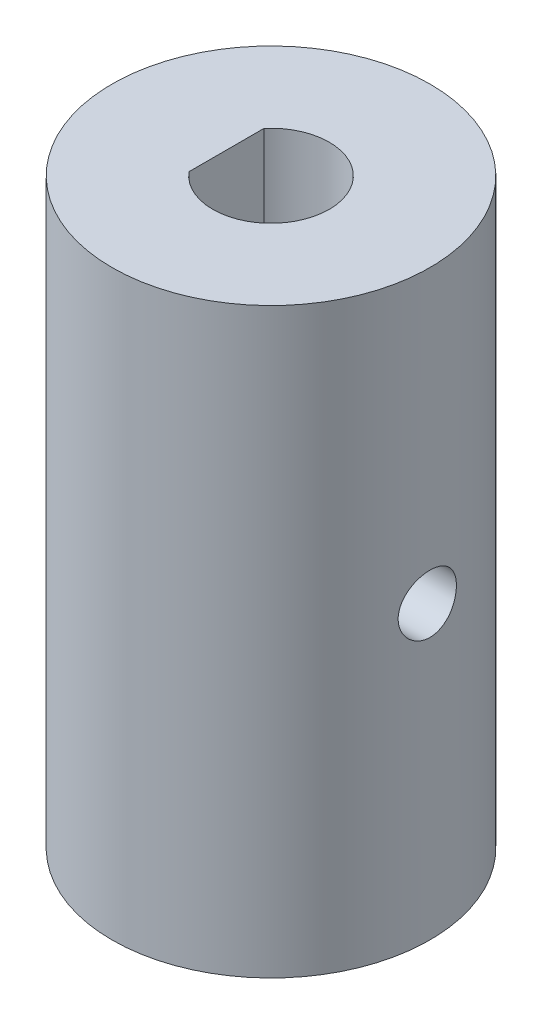
ISO-10303-21;
HEADER;
FILE_DESCRIPTION(('STEP AP214'),'2;1');
FILE_NAME('part.step','',(''),(''),'','','');
FILE_SCHEMA(('AUTOMOTIVE_DESIGN { 1 0 10303 214 1 1 1 1 }'));
ENDSEC;
DATA;
#1=APPLICATION_CONTEXT('core data for automotive mechanical design processes');
#2=APPLICATION_PROTOCOL_DEFINITION('international standard','automotive_design',2000,#1);
#3=PRODUCT_CONTEXT('',#1,'mechanical');
#4=PRODUCT('Part','Part','',(#3));
#5=PRODUCT_RELATED_PRODUCT_CATEGORY('part','',(#4));
#6=PRODUCT_DEFINITION_FORMATION('','',#4);
#7=PRODUCT_DEFINITION_CONTEXT('part definition',#1,'design');
#8=PRODUCT_DEFINITION('design','',#6,#7);
#9=PRODUCT_DEFINITION_SHAPE('','',#8);
#10=(LENGTH_UNIT() NAMED_UNIT(*) SI_UNIT(.MILLI.,.METRE.));
#11=(NAMED_UNIT(*) PLANE_ANGLE_UNIT() SI_UNIT($,.RADIAN.));
#12=(NAMED_UNIT(*) SI_UNIT($,.STERADIAN.) SOLID_ANGLE_UNIT());
#13=UNCERTAINTY_MEASURE_WITH_UNIT(LENGTH_MEASURE(1.E-05),#10,'distance_accuracy_value','');
#14=(GEOMETRIC_REPRESENTATION_CONTEXT(3) GLOBAL_UNCERTAINTY_ASSIGNED_CONTEXT((#13)) GLOBAL_UNIT_ASSIGNED_CONTEXT((#10,
#11,#12)) REPRESENTATION_CONTEXT('',''));
#15=CARTESIAN_POINT('',(0.,0.,0.));
#16=DIRECTION('',(0.,0.,1.));
#17=DIRECTION('',(1.,0.,0.));
#18=AXIS2_PLACEMENT_3D('',#15,#16,#17);
#19=CARTESIAN_POINT('',(0.,30.,0.));
#20=DIRECTION('',(0.,-1.,0.));
#21=DIRECTION('',(0.,0.,-1.));
#22=AXIS2_PLACEMENT_3D('',#19,#20,#21);
#23=CYLINDRICAL_SURFACE('',#22,8.1890069126629);
#24=CARTESIAN_POINT('',(0.,30.,0.));
#25=DIRECTION('',(0.,1.,0.));
#26=DIRECTION('',(0.,0.,1.));
#27=AXIS2_PLACEMENT_3D('',#24,#25,#26);
#28=CIRCLE('',#27,8.1890069126629);
#29=CARTESIAN_POINT('',(0.,30.,8.1890069126629));
#30=VERTEX_POINT('',#29);
#31=EDGE_CURVE('E103',#30,#30,#28,.T.);
#32=ORIENTED_EDGE('',*,*,#31,.F.);
#33=EDGE_LOOP('',(#32));
#34=FACE_BOUND('',#33,.T.);
#35=CARTESIAN_POINT('',(0.,0.,0.));
#36=DIRECTION('',(0.,1.,0.));
#37=DIRECTION('',(0.,0.,1.));
#38=AXIS2_PLACEMENT_3D('',#35,#36,#37);
#39=CIRCLE('',#38,8.1890069126629);
#40=CARTESIAN_POINT('',(0.,0.,8.1890069126629));
#41=VERTEX_POINT('',#40);
#42=EDGE_CURVE('E101',#41,#41,#39,.T.);
#43=ORIENTED_EDGE('',*,*,#42,.T.);
#44=EDGE_LOOP('',(#43));
#45=FACE_BOUND('',#44,.T.);
#46=CARTESIAN_POINT('',(-8.05045552845556,15.,1.5));
#47=CARTESIAN_POINT('',(-8.05045712508259,15.0834938156143,1.4999967617717));
#48=CARTESIAN_POINT('',(-8.05176853870894,15.1670300636327,1.49300513990406));
#49=CARTESIAN_POINT('',(-8.05686634931734,15.3317495697272,1.4652407751053));
#50=CARTESIAN_POINT('',(-8.06065488543688,15.4129307307125,1.44445612086685));
#51=CARTESIAN_POINT('',(-8.07026379045823,15.5705327738723,1.38976326790009));
#52=CARTESIAN_POINT('',(-8.07608230855931,15.6469579177234,1.3558670203884));
#53=CARTESIAN_POINT('',(-8.08909338794624,15.7930311217619,1.27594444054268));
#54=CARTESIAN_POINT('',(-8.09628583178107,15.862679760476,1.22991914494129));
#55=CARTESIAN_POINT('',(-8.11132982233989,15.9940563428632,1.1264619396305));
#56=CARTESIAN_POINT('',(-8.11918757044286,16.0556920738239,1.06891381680938));
#57=CARTESIAN_POINT('',(-8.13462196064732,16.1684903395025,0.944295708381804));
#58=CARTESIAN_POINT('',(-8.14219858466923,16.2196522015802,0.87722511170261));
#59=CARTESIAN_POINT('',(-8.15628331442015,16.3104022557995,0.73486198244097));
#60=CARTESIAN_POINT('',(-8.1627832648426,16.3499037419658,0.659513302848179));
#61=CARTESIAN_POINT('',(-8.17391295020838,16.4156534094499,0.503110300253054));
#62=CARTESIAN_POINT('',(-8.17854283188648,16.4419026306458,0.422056425494573));
#63=CARTESIAN_POINT('',(-8.18536692056306,16.4801181605587,0.25749885992804));
#64=CARTESIAN_POINT('',(-8.18758760043035,16.4922398184696,0.174032362073648));
#65=CARTESIAN_POINT('',(-8.18943425788382,16.5023399658799,0.00622277752115519));
#66=CARTESIAN_POINT('',(-8.18906044675426,16.5003196070446,-0.0781202372386139));
#67=CARTESIAN_POINT('',(-8.18578098641724,16.4823126494839,-0.244223994695151));
#68=CARTESIAN_POINT('',(-8.18290565840816,16.4664933039704,-0.326003553901673));
#69=CARTESIAN_POINT('',(-8.1749801954825,16.4216016988468,-0.485727469751366));
#70=CARTESIAN_POINT('',(-8.1699299840118,16.3925289727264,-0.563671691286156));
#71=CARTESIAN_POINT('',(-8.15817130484192,16.3217950337718,-0.714000173868226));
#72=CARTESIAN_POINT('',(-8.15145400709458,16.2800665169073,-0.786352047526514));
#73=CARTESIAN_POINT('',(-8.13710477696812,16.1852550435009,-0.92308926590461));
#74=CARTESIAN_POINT('',(-8.12947275569904,16.1321709830689,-0.987473835149089));
#75=CARTESIAN_POINT('',(-8.11400831391879,16.0152323038722,-1.10743919023639));
#76=CARTESIAN_POINT('',(-8.10617459531773,15.9512313868407,-1.16287729522729));
#77=CARTESIAN_POINT('',(-8.09129673862161,15.8147642945198,-1.26225347514702));
#78=CARTESIAN_POINT('',(-8.08425261106319,15.7422980062913,-1.30619139662293));
#79=CARTESIAN_POINT('',(-8.07174985721038,15.5907732147081,-1.38135788366981));
#80=CARTESIAN_POINT('',(-8.06629372476261,15.5117045906958,-1.41256648916948));
#81=CARTESIAN_POINT('',(-8.05762351420779,15.3493240106681,-1.4612166877625));
#82=CARTESIAN_POINT('',(-8.05440919452616,15.2660125128973,-1.47865976423639));
#83=CARTESIAN_POINT('',(-8.05063412373908,15.0987955403852,-1.49907705454895));
#84=CARTESIAN_POINT('',(-8.05003584479144,15.0149158744904,-1.50225591017226));
#85=CARTESIAN_POINT('',(-8.0514602723565,14.8478240523423,-1.49460239017643));
#86=CARTESIAN_POINT('',(-8.05348285547777,14.7646118648495,-1.48377067418173));
#87=CARTESIAN_POINT('',(-8.05988621764376,14.6018849099344,-1.44857890809767));
#88=CARTESIAN_POINT('',(-8.06424840605489,14.5223462913999,-1.42432546016269));
#89=CARTESIAN_POINT('',(-8.07482354515098,14.3684618514744,-1.36309152053184));
#90=CARTESIAN_POINT('',(-8.08103662677984,14.2941163979404,-1.32611012835186));
#91=CARTESIAN_POINT('',(-8.09469933246159,14.1518251332918,-1.23999647745459));
#92=CARTESIAN_POINT('',(-8.10216185476365,14.0839590654254,-1.19073453844537));
#93=CARTESIAN_POINT('',(-8.11744601502593,13.9573825709202,-1.08163370078844));
#94=CARTESIAN_POINT('',(-8.12526768369476,13.8986729290901,-1.02179389643542));
#95=CARTESIAN_POINT('',(-8.14050901925255,13.7913150533739,-0.892323545165104));
#96=CARTESIAN_POINT('',(-8.14792231223957,13.742804201772,-0.822578212085143));
#97=CARTESIAN_POINT('',(-8.16140549390728,13.6581889449898,-0.675808712874692));
#98=CARTESIAN_POINT('',(-8.16747543262113,13.6220840777215,-0.598784817986432));
#99=CARTESIAN_POINT('',(-8.17756051384598,13.5635131080834,-0.440030368578521));
#100=CARTESIAN_POINT('',(-8.18158594842773,13.5409785836098,-0.358325740104585));
#101=CARTESIAN_POINT('',(-8.18717228596062,13.5099691496396,-0.192211023691791));
#102=CARTESIAN_POINT('',(-8.18873343588041,13.5014928312363,-0.107801207729903));
#103=CARTESIAN_POINT('',(-8.18921070214651,13.4988876336528,0.0600084943477177));
#104=CARTESIAN_POINT('',(-8.18816513168698,13.5045509341977,0.14340511669388));
#105=CARTESIAN_POINT('',(-8.18362574648551,13.5296102812759,0.308037353841497));
#106=CARTESIAN_POINT('',(-8.18013195294657,13.5490062088768,0.389272987352023));
#107=CARTESIAN_POINT('',(-8.17108830458502,13.6008943078247,0.547173994655786));
#108=CARTESIAN_POINT('',(-8.16554177372683,13.6333653143485,0.623846525686286));
#109=CARTESIAN_POINT('',(-8.152994157933,13.7104573407877,0.770686339753857));
#110=CARTESIAN_POINT('',(-8.14599298155967,13.7550791245448,0.840853213450021));
#111=CARTESIAN_POINT('',(-8.13118836753238,13.8559260889736,0.973728060142116));
#112=CARTESIAN_POINT('',(-8.12337525222211,13.9123018734933,1.03632066539604));
#113=CARTESIAN_POINT('',(-8.10788967358951,14.0347431281641,1.15122951116567));
#114=CARTESIAN_POINT('',(-8.10021724372751,14.1008108706461,1.20354333501936));
#115=CARTESIAN_POINT('',(-8.08580843580313,14.24145250559,1.29683860628769));
#116=CARTESIAN_POINT('',(-8.07908085142835,14.3160958771223,1.3377167091771));
#117=CARTESIAN_POINT('',(-8.06742879793818,14.4712883631418,1.40628821789744));
#118=CARTESIAN_POINT('',(-8.06250260612164,14.5518317463842,1.43399422806801));
#119=CARTESIAN_POINT('',(-8.05605259568235,14.693858488865,1.46971966709668));
#120=CARTESIAN_POINT('',(-8.05396598446343,14.7545037447911,1.48105560617139));
#121=CARTESIAN_POINT('',(-8.05116687877529,14.8767583095955,1.49619687346074));
#122=CARTESIAN_POINT('',(-8.05045434987767,14.9383675942805,1.50000239035429));
#123=CARTESIAN_POINT('',(-8.05045552845556,15.,1.5));
#124=B_SPLINE_CURVE_WITH_KNOTS('',3,(#46,#47,#48,#49,#50,#51,#52,#53,#54,#55,#56,#57,#58,#59,
#60,#61,#62,#63,#64,#65,#66,#67,#68,#69,#70,#71,#72,#73,#74,#75,#76,#77,#78,#79,#80,#81,#82,#83,
#84,#85,#86,#87,#88,#89,#90,#91,#92,#93,#94,#95,#96,#97,#98,#99,#100,#101,#102,#103,#104,#105,
#106,#107,#108,#109,#110,#111,#112,#113,#114,#115,#116,#117,#118,#119,#120,#121,#122,#123),
.UNSPECIFIED.,.T.,.F.,(4,2,2,2,2,2,2,2,2,2,2,2,2,2,2,2,2,2,2,2,2,2,2,2,2,2,2,2,2,2,2,2,2,2,2,2,
2,2,4),(0.,0.250255939526254,0.500728275356629,0.750972841613708,1.00119602510382,
1.25408295696729,1.50698612434019,1.76172505069723,2.01644398510423,2.26833473926557,
2.52020498076042,2.76906414838135,3.01793207635834,3.26814741839374,3.51838709531706,
3.77229013933149,4.0261965711333,4.28049962169429,4.53477526468337,4.78539102867204,
5.03599499397951,5.28463652500905,5.53329565069386,5.78470089623965,6.03612767821493,
6.29075047743674,6.54536379164738,6.79868234811986,7.05197551559412,7.30156782780784,
7.55115797843633,7.80034572758294,8.04954914518698,8.3021669466382,8.55484407061273,
8.80973585232631,9.06438323541325,9.24911861914774,9.43384937417561),.UNSPECIFIED.);
#125=CARTESIAN_POINT('',(-8.05045552845556,15.,1.5));
#126=VERTEX_POINT('',#125);
#127=EDGE_CURVE('E96',#126,#126,#124,.T.);
#128=ORIENTED_EDGE('',*,*,#127,.F.);
#129=EDGE_LOOP('',(#128));
#130=FACE_BOUND('',#129,.T.);
#131=CARTESIAN_POINT('',(8.05045552845556,15.,1.5));
#132=CARTESIAN_POINT('',(8.05045712508259,14.9165061843857,1.4999967617717));
#133=CARTESIAN_POINT('',(8.05176853870894,14.8329699363673,1.49300513990406));
#134=CARTESIAN_POINT('',(8.05686634931734,14.6682504302728,1.4652407751053));
#135=CARTESIAN_POINT('',(8.06065488543688,14.5870692692875,1.44445612086685));
#136=CARTESIAN_POINT('',(8.07026379045823,14.4294672261277,1.38976326790009));
#137=CARTESIAN_POINT('',(8.07608230855931,14.3530420822766,1.3558670203884));
#138=CARTESIAN_POINT('',(8.08909338794624,14.2069688782381,1.27594444054268));
#139=CARTESIAN_POINT('',(8.09628583178107,14.137320239524,1.22991914494129));
#140=CARTESIAN_POINT('',(8.11132982233989,14.0059436571368,1.1264619396305));
#141=CARTESIAN_POINT('',(8.11918757044286,13.9443079261761,1.06891381680938));
#142=CARTESIAN_POINT('',(8.13462196064732,13.8315096604975,0.944295708381804));
#143=CARTESIAN_POINT('',(8.14219858466923,13.7803477984198,0.877225111702611));
#144=CARTESIAN_POINT('',(8.15628331442015,13.6895977442005,0.734861982440971));
#145=CARTESIAN_POINT('',(8.16278326484259,13.6500962580342,0.659513302848181));
#146=CARTESIAN_POINT('',(8.17391295020838,13.5843465905501,0.503110300253056));
#147=CARTESIAN_POINT('',(8.17854283188648,13.5580973693542,0.422056425494575));
#148=CARTESIAN_POINT('',(8.18536692056306,13.5198818394413,0.257498859928042));
#149=CARTESIAN_POINT('',(8.18758760043035,13.5077601815304,0.174032362073649));
#150=CARTESIAN_POINT('',(8.18943425788382,13.4976600341201,0.00622277752115572));
#151=CARTESIAN_POINT('',(8.18906044675426,13.4996803929554,-0.0781202372386137));
#152=CARTESIAN_POINT('',(8.18578098641724,13.5176873505161,-0.244223994695151));
#153=CARTESIAN_POINT('',(8.18290565840816,13.5335066960296,-0.326003553901673));
#154=CARTESIAN_POINT('',(8.1749801954825,13.5783983011532,-0.485727469751367));
#155=CARTESIAN_POINT('',(8.1699299840118,13.6074710272736,-0.563671691286157));
#156=CARTESIAN_POINT('',(8.15817130484192,13.6782049662282,-0.714000173868226));
#157=CARTESIAN_POINT('',(8.15145400709458,13.7199334830927,-0.786352047526514));
#158=CARTESIAN_POINT('',(8.13710477696812,13.8147449564991,-0.92308926590461));
#159=CARTESIAN_POINT('',(8.12947275569904,13.8678290169311,-0.98747383514909));
#160=CARTESIAN_POINT('',(8.11400831391879,13.9847676961278,-1.10743919023639));
#161=CARTESIAN_POINT('',(8.10617459531773,14.0487686131593,-1.16287729522729));
#162=CARTESIAN_POINT('',(8.09129673862161,14.1852357054802,-1.26225347514702));
#163=CARTESIAN_POINT('',(8.08425261106319,14.2577019937087,-1.30619139662293));
#164=CARTESIAN_POINT('',(8.07174985721038,14.4092267852919,-1.38135788366982));
#165=CARTESIAN_POINT('',(8.06629372476261,14.4882954093042,-1.41256648916948));
#166=CARTESIAN_POINT('',(8.05762351420779,14.6506759893319,-1.4612166877625));
#167=CARTESIAN_POINT('',(8.05440919452616,14.7339874871027,-1.47865976423639));
#168=CARTESIAN_POINT('',(8.05063412373908,14.9012044596148,-1.49907705454895));
#169=CARTESIAN_POINT('',(8.05003584479144,14.9850841255096,-1.50225591017226));
#170=CARTESIAN_POINT('',(8.0514602723565,15.1521759476577,-1.49460239017643));
#171=CARTESIAN_POINT('',(8.05348285547777,15.2353881351505,-1.48377067418172));
#172=CARTESIAN_POINT('',(8.05988621764376,15.3981150900656,-1.44857890809767));
#173=CARTESIAN_POINT('',(8.06424840605489,15.4776537086001,-1.42432546016269));
#174=CARTESIAN_POINT('',(8.07482354515098,15.6315381485256,-1.36309152053184));
#175=CARTESIAN_POINT('',(8.08103662677984,15.7058836020596,-1.32611012835186));
#176=CARTESIAN_POINT('',(8.09469933246159,15.8481748667082,-1.23999647745459));
#177=CARTESIAN_POINT('',(8.10216185476365,15.9160409345746,-1.19073453844537));
#178=CARTESIAN_POINT('',(8.11744601502593,16.0426174290798,-1.08163370078844));
#179=CARTESIAN_POINT('',(8.12526768369476,16.1013270709099,-1.02179389643542));
#180=CARTESIAN_POINT('',(8.14050901925255,16.2086849466261,-0.892323545165102));
#181=CARTESIAN_POINT('',(8.14792231223957,16.257195798228,-0.822578212085141));
#182=CARTESIAN_POINT('',(8.16140549390728,16.3418110550102,-0.675808712874691));
#183=CARTESIAN_POINT('',(8.16747543262113,16.3779159222785,-0.598784817986431));
#184=CARTESIAN_POINT('',(8.17756051384598,16.4364868919166,-0.440030368578522));
#185=CARTESIAN_POINT('',(8.18158594842773,16.4590214163902,-0.358325740104585));
#186=CARTESIAN_POINT('',(8.18717228596062,16.4900308503604,-0.192211023691791));
#187=CARTESIAN_POINT('',(8.18873343588041,16.4985071687637,-0.107801207729902));
#188=CARTESIAN_POINT('',(8.18921070214651,16.5011123663472,0.0600084943477179));
#189=CARTESIAN_POINT('',(8.18816513168698,16.4954490658023,0.14340511669388));
#190=CARTESIAN_POINT('',(8.18362574648551,16.4703897187241,0.308037353841497));
#191=CARTESIAN_POINT('',(8.18013195294657,16.4509937911232,0.389272987352023));
#192=CARTESIAN_POINT('',(8.17108830458502,16.3991056921753,0.547173994655786));
#193=CARTESIAN_POINT('',(8.16554177372683,16.3666346856515,0.623846525686286));
#194=CARTESIAN_POINT('',(8.152994157933,16.2895426592123,0.770686339753857));
#195=CARTESIAN_POINT('',(8.14599298155967,16.2449208754552,0.840853213450021));
#196=CARTESIAN_POINT('',(8.13118836753238,16.1440739110264,0.973728060142117));
#197=CARTESIAN_POINT('',(8.12337525222211,16.0876981265067,1.03632066539604));
#198=CARTESIAN_POINT('',(8.10788967358951,15.9652568718359,1.15122951116567));
#199=CARTESIAN_POINT('',(8.10021724372751,15.8991891293539,1.20354333501936));
#200=CARTESIAN_POINT('',(8.08580843580313,15.75854749441,1.29683860628769));
#201=CARTESIAN_POINT('',(8.07908085142835,15.6839041228777,1.33771670917709));
#202=CARTESIAN_POINT('',(8.06742879793818,15.5287116368582,1.40628821789744));
#203=CARTESIAN_POINT('',(8.06250260612164,15.4481682536158,1.43399422806801));
#204=CARTESIAN_POINT('',(8.05605259568235,15.306141511135,1.46971966709668));
#205=CARTESIAN_POINT('',(8.05396598446343,15.2454962552089,1.48105560617139));
#206=CARTESIAN_POINT('',(8.05116687877529,15.1232416904045,1.49619687346074));
#207=CARTESIAN_POINT('',(8.05045434987767,15.0616324057195,1.50000239035429));
#208=CARTESIAN_POINT('',(8.05045552845556,15.,1.5));
#209=B_SPLINE_CURVE_WITH_KNOTS('',3,(#131,#132,#133,#134,#135,#136,#137,#138,#139,#140,#141,
#142,#143,#144,#145,#146,#147,#148,#149,#150,#151,#152,#153,#154,#155,#156,#157,#158,#159,#160,
#161,#162,#163,#164,#165,#166,#167,#168,#169,#170,#171,#172,#173,#174,#175,#176,#177,#178,#179,
#180,#181,#182,#183,#184,#185,#186,#187,#188,#189,#190,#191,#192,#193,#194,#195,#196,#197,#198,
#199,#200,#201,#202,#203,#204,#205,#206,#207,#208),.UNSPECIFIED.,.T.,.F.,(4,2,2,2,2,2,2,2,2,2,2,
2,2,2,2,2,2,2,2,2,2,2,2,2,2,2,2,2,2,2,2,2,2,2,2,2,2,2,4),(0.,0.250255939526254,
0.500728275356629,0.750972841613708,1.00119602510381,1.25408295696729,1.50698612434018,
1.76172505069722,2.01644398510422,2.26833473926557,2.52020498076042,2.76906414838135,
3.01793207635834,3.26814741839374,3.51838709531706,3.77229013933149,4.0261965711333,
4.2804996216943,4.53477526468337,4.78539102867204,5.03599499397952,5.28463652500905,
5.53329565069386,5.78470089623965,6.03612767821494,6.29075047743675,6.54536379164738,
6.79868234811987,7.05197551559412,7.30156782780784,7.55115797843633,7.80034572758293,
8.04954914518698,8.3021669466382,8.55484407061273,8.80973585232631,9.06438323541325,
9.24911861914774,9.4338493741756),.UNSPECIFIED.);
#210=CARTESIAN_POINT('',(8.05045552845556,15.,1.5));
#211=VERTEX_POINT('',#210);
#212=EDGE_CURVE('E90',#211,#211,#209,.T.);
#213=ORIENTED_EDGE('',*,*,#212,.F.);
#214=EDGE_LOOP('',(#213));
#215=FACE_BOUND('',#214,.T.);
#216=ADVANCED_FACE('F39',(#34,#45,#130,#215),#23,.T.);
#217=CARTESIAN_POINT('',(0.,0.,0.));
#218=DIRECTION('',(0.,1.,0.));
#219=DIRECTION('',(0.,0.,1.));
#220=AXIS2_PLACEMENT_3D('',#217,#218,#219);
#221=CYLINDRICAL_SURFACE('',#220,3.);
#222=CARTESIAN_POINT('',(0.,30.,0.));
#223=DIRECTION('',(0.,1.,0.));
#224=DIRECTION('',(0.,0.,1.));
#225=AXIS2_PLACEMENT_3D('',#222,#223,#224);
#226=CIRCLE('',#225,3.);
#227=CARTESIAN_POINT('',(-2.2951076558143,30.,1.93196295208335));
#228=VERTEX_POINT('',#227);
#229=CARTESIAN_POINT('',(-2.2951076558143,30.,-1.93196295208335));
#230=VERTEX_POINT('',#229);
#231=EDGE_CURVE('E71',#228,#230,#226,.T.);
#232=ORIENTED_EDGE('',*,*,#231,.T.);
#233=DIRECTION('',(0.,1.,0.));
#234=VECTOR('',#233,1.);
#235=CARTESIAN_POINT('',(-2.2951076558143,0.,-1.93196295208335));
#236=LINE('',#235,#234);
#237=CARTESIAN_POINT('',(-2.2951076558143,20.,-1.93196295208335));
#238=VERTEX_POINT('',#237);
#239=EDGE_CURVE('E11',#230,#238,#236,.F.);
#240=ORIENTED_EDGE('',*,*,#239,.T.);
#241=CARTESIAN_POINT('',(0.,20.,0.));
#242=DIRECTION('',(0.,1.,0.));
#243=DIRECTION('',(0.,0.,1.));
#244=AXIS2_PLACEMENT_3D('',#241,#242,#243);
#245=CIRCLE('',#244,3.);
#246=CARTESIAN_POINT('',(-2.2951076558143,20.,1.93196295208335));
#247=VERTEX_POINT('',#246);
#248=EDGE_CURVE('E54',#247,#238,#245,.F.);
#249=ORIENTED_EDGE('',*,*,#248,.F.);
#250=DIRECTION('',(0.,1.,0.));
#251=VECTOR('',#250,1.);
#252=CARTESIAN_POINT('',(-2.2951076558143,20.,1.93196295208335));
#253=LINE('',#252,#251);
#254=EDGE_CURVE('E78',#247,#228,#253,.T.);
#255=ORIENTED_EDGE('',*,*,#254,.T.);
#256=EDGE_LOOP('',(#232,#240,#249,#255));
#257=FACE_BOUND('',#256,.T.);
#258=CARTESIAN_POINT('',(0.,0.,0.));
#259=DIRECTION('',(0.,1.,0.));
#260=DIRECTION('',(0.,0.,1.));
#261=AXIS2_PLACEMENT_3D('',#258,#259,#260);
#262=CIRCLE('',#261,3.);
#263=CARTESIAN_POINT('',(0.,0.,3.));
#264=VERTEX_POINT('',#263);
#265=EDGE_CURVE('E77',#264,#264,#262,.T.);
#266=ORIENTED_EDGE('',*,*,#265,.F.);
#267=EDGE_LOOP('',(#266));
#268=FACE_BOUND('',#267,.T.);
#269=CARTESIAN_POINT('',(-2.59807621135332,15.,1.5));
#270=CARTESIAN_POINT('',(-2.59808302092689,14.9218382877071,1.4999945446118));
#271=CARTESIAN_POINT('',(-2.60165701781635,14.8435778827124,1.49384995609983));
#272=CARTESIAN_POINT('',(-2.61543549678079,14.6894591029843,1.46958481484708));
#273=CARTESIAN_POINT('',(-2.62565391083339,14.6136061274349,1.45143909683127));
#274=CARTESIAN_POINT('',(-2.65124019908098,14.4668225034841,1.40414992304972));
#275=CARTESIAN_POINT('',(-2.66658065209878,14.3958680212896,1.3750649287406));
#276=CARTESIAN_POINT('',(-2.70063997225287,14.2598636970049,1.30690128806456));
#277=CARTESIAN_POINT('',(-2.71935902214097,14.1948141746063,1.26782210105366));
#278=CARTESIAN_POINT('',(-2.75995303586162,14.0665414071637,1.17699981079632));
#279=CARTESIAN_POINT('',(-2.7819609545693,14.0039112964897,1.12447805421566));
#280=CARTESIAN_POINT('',(-2.82557974178559,13.8878874173899,1.0098807114217));
#281=CARTESIAN_POINT('',(-2.84719040746875,13.8344982561247,0.94780038867344));
#282=CARTESIAN_POINT('',(-2.88932215429424,13.7349492732785,0.81073434512182));
#283=CARTESIAN_POINT('',(-2.90967159627259,13.6895193482107,0.735160783518862));
#284=CARTESIAN_POINT('',(-2.94526134149294,13.6122887201314,0.576235539899256));
#285=CARTESIAN_POINT('',(-2.96050486775612,13.5804794157942,0.492888807207233));
#286=CARTESIAN_POINT('',(-2.98320691866356,13.5337430080484,0.327067415888967));
#287=CARTESIAN_POINT('',(-2.99114220331338,13.5177757104667,0.244952685733227));
#288=CARTESIAN_POINT('',(-3.00011375769101,13.4997508219874,0.078855943046773));
#289=CARTESIAN_POINT('',(-3.00115420176885,13.4976848148064,-0.00512490876560692));
#290=CARTESIAN_POINT('',(-2.99644472874675,13.5071200109555,-0.164748786635624));
#291=CARTESIAN_POINT('',(-2.99127743838241,13.5174570232818,-0.240481798765186));
#292=CARTESIAN_POINT('',(-2.97561367889621,13.549321265857,-0.388970657877482));
#293=CARTESIAN_POINT('',(-2.96511681099591,13.5708493334643,-0.461726281640887));
#294=CARTESIAN_POINT('',(-2.93957374931482,13.6246238491347,-0.603464087354329));
#295=CARTESIAN_POINT('',(-2.92446662293799,13.6570144697581,-0.672380135272766));
#296=CARTESIAN_POINT('',(-2.89106468980031,13.7313951243022,-0.803965202269992));
#297=CARTESIAN_POINT('',(-2.87276874236226,13.7733885949535,-0.866631973257968));
#298=CARTESIAN_POINT('',(-2.83266591598844,13.8703430272995,-0.990260491347291));
#299=CARTESIAN_POINT('',(-2.81069063997263,13.926154542489,-1.05050111254404));
#300=CARTESIAN_POINT('',(-2.76681510880218,14.0468845873953,-1.16115655544667));
#301=CARTESIAN_POINT('',(-2.74491492398443,14.1118100584111,-1.21156381736135));
#302=CARTESIAN_POINT('',(-2.70216234138727,14.2539722886361,-1.30425800196332));
#303=CARTESIAN_POINT('',(-2.68146479986061,14.3317290345813,-1.34582597246708));
#304=CARTESIAN_POINT('',(-2.64563175417864,14.4944065070385,-1.41497866950185));
#305=CARTESIAN_POINT('',(-2.63049045069101,14.5793196495263,-1.44257798731633));
#306=CARTESIAN_POINT('',(-2.60916953725552,14.7468217669242,-1.48077031653756));
#307=CARTESIAN_POINT('',(-2.60237483772745,14.8290616785653,-1.49253768317996));
#308=CARTESIAN_POINT('',(-2.59676879042414,14.9946020122748,-1.50227541991714));
#309=CARTESIAN_POINT('',(-2.59795180333967,15.0779016436797,-1.50025553597254));
#310=CARTESIAN_POINT('',(-2.60751504810877,15.2334808778681,-1.48355406501595));
#311=CARTESIAN_POINT('',(-2.61509381259981,15.3059691766619,-1.4702817250687));
#312=CARTESIAN_POINT('',(-2.63541032327012,15.4475516794064,-1.43354442694866));
#313=CARTESIAN_POINT('',(-2.64814974007551,15.5166447761199,-1.41007616793542));
#314=CARTESIAN_POINT('',(-2.67804333119485,15.653116996354,-1.35247138290733));
#315=CARTESIAN_POINT('',(-2.69537464864595,15.7202685252803,-1.31789109553909));
#316=CARTESIAN_POINT('',(-2.73234179245875,15.8482039073085,-1.23943059602371));
#317=CARTESIAN_POINT('',(-2.75197880032721,15.9089844652699,-1.19554560649832));
#318=CARTESIAN_POINT('',(-2.79431997684504,16.0304681512853,-1.09325575079828));
#319=CARTESIAN_POINT('',(-2.81709874731434,16.0901957260765,-1.03371790847245));
#320=CARTESIAN_POINT('',(-2.86101352466839,16.1991183569904,-0.905106743097435));
#321=CARTESIAN_POINT('',(-2.88214897511564,16.2483098553458,-0.836030211983023));
#322=CARTESIAN_POINT('',(-2.92112042536435,16.3358605889252,-0.687803043838138));
#323=CARTESIAN_POINT('',(-2.93885462508044,16.3738996773164,-0.608434646361172));
#324=CARTESIAN_POINT('',(-2.96825032438951,16.4357068557861,-0.443283546961625));
#325=CARTESIAN_POINT('',(-2.9799171551456,16.4594874770495,-0.357506552088266));
#326=CARTESIAN_POINT('',(-2.99501262272824,16.490052846262,-0.190469523495627));
#327=CARTESIAN_POINT('',(-2.99909891862287,16.4981968138142,-0.109517165775687));
#328=CARTESIAN_POINT('',(-3.00063195562697,16.5012648981816,0.0526889789268046));
#329=CARTESIAN_POINT('',(-2.99808102100335,16.4961936427854,0.13394265044263));
#330=CARTESIAN_POINT('',(-2.98700953256884,16.4738753898066,0.28880698847572));
#331=CARTESIAN_POINT('',(-2.97889342001985,16.4574527261135,0.362568476716895));
#332=CARTESIAN_POINT('',(-2.95788140495135,16.4140095010455,0.506168928275425));
#333=CARTESIAN_POINT('',(-2.94498481699194,16.3869874198598,0.576007327433262));
#334=CARTESIAN_POINT('',(-2.9148889612218,16.321909421751,0.713135109367326));
#335=CARTESIAN_POINT('',(-2.89752925798199,16.2834310151882,0.780187714050068));
#336=CARTESIAN_POINT('',(-2.86032199712739,16.1970631037114,0.907161962721036));
#337=CARTESIAN_POINT('',(-2.84047329837541,16.1491692763265,0.96708031112236));
#338=CARTESIAN_POINT('',(-2.79792915339941,16.0398042914659,1.08437100623534));
#339=CARTESIAN_POINT('',(-2.77514698517547,15.9774562687842,1.14089652680891));
#340=CARTESIAN_POINT('',(-2.73094614244278,15.8438239183053,1.24299493109201));
#341=CARTESIAN_POINT('',(-2.70952868642798,15.7725317686985,1.28855812501509));
#342=CARTESIAN_POINT('',(-2.66999407957374,15.6200450301286,1.36864661967848));
#343=CARTESIAN_POINT('',(-2.65200261384405,15.5386087033069,1.40277759894141));
#344=CARTESIAN_POINT('',(-2.62299234492527,15.3700013934903,1.45631806425962));
#345=CARTESIAN_POINT('',(-2.61195024221553,15.282850666631,1.47577678676302));
#346=CARTESIAN_POINT('',(-2.60293908902686,15.162291966522,1.49155051179662));
#347=CARTESIAN_POINT('',(-2.60112193507728,15.1299481584032,1.49471415744578));
#348=CARTESIAN_POINT('',(-2.59868903831625,15.0650752789766,1.49894010763495));
#349=CARTESIAN_POINT('',(-2.59807337587664,15.0325461954212,1.50000227159981));
#350=CARTESIAN_POINT('',(-2.59807621135332,15.,1.5));
#351=B_SPLINE_CURVE_WITH_KNOTS('',3,(#269,#270,#271,#272,#273,#274,#275,#276,#277,#278,#279,
#280,#281,#282,#283,#284,#285,#286,#287,#288,#289,#290,#291,#292,#293,#294,#295,#296,#297,#298,
#299,#300,#301,#302,#303,#304,#305,#306,#307,#308,#309,#310,#311,#312,#313,#314,#315,#316,#317,
#318,#319,#320,#321,#322,#323,#324,#325,#326,#327,#328,#329,#330,#331,#332,#333,#334,#335,#336,
#337,#338,#339,#340,#341,#342,#343,#344,#345,#346,#347,#348,#349,#350),.UNSPECIFIED.,.T.,.F.,(4,
2,2,2,2,2,2,2,2,2,2,2,2,2,2,2,2,2,2,2,2,2,2,2,2,2,2,2,2,2,2,2,2,2,2,2,2,2,2,2,4),(0.,
0.234348183892073,0.469189339237207,0.702792893878329,0.936409088167724,1.18929346874735,
1.44230356626557,1.71236838358145,1.98226240445837,2.23295227451903,2.4834903552906,
2.71224146226808,2.94100968776183,3.1729430209672,3.40495949025408,3.65890787185336,
3.91305072368878,4.18333262594173,4.45333161317557,4.70193436281318,4.9503613978256,
5.17161275136038,5.39293578654095,5.62450944609132,5.85620229330071,6.1171011537092,
6.37808797467303,6.64596272119449,6.91360169713157,7.1566840558423,7.39968130190958,
7.62666637307239,7.8536840026802,8.09041126079208,8.32724745151079,8.58765362775102,
8.84828914267731,9.11716123557907,9.38512699504141,9.48270202777964,9.58028358741811),.UNSPECIFIED.);
#352=CARTESIAN_POINT('',(-2.59807621135332,15.,1.5));
#353=VERTEX_POINT('',#352);
#354=EDGE_CURVE('E111',#353,#353,#351,.T.);
#355=ORIENTED_EDGE('',*,*,#354,.F.);
#356=EDGE_LOOP('',(#355));
#357=FACE_BOUND('',#356,.T.);
#358=CARTESIAN_POINT('',(2.59807621135332,15.,1.5));
#359=CARTESIAN_POINT('',(2.59808302092689,15.0781617122929,1.4999945446118));
#360=CARTESIAN_POINT('',(2.60165701781635,15.1564221172876,1.49384995609983));
#361=CARTESIAN_POINT('',(2.61543549678079,15.3105408970157,1.46958481484708));
#362=CARTESIAN_POINT('',(2.62565391083339,15.3863938725651,1.45143909683127));
#363=CARTESIAN_POINT('',(2.65124019908098,15.5331774965159,1.40414992304972));
#364=CARTESIAN_POINT('',(2.66658065209878,15.6041319787104,1.3750649287406));
#365=CARTESIAN_POINT('',(2.70063997225287,15.7401363029951,1.30690128806456));
#366=CARTESIAN_POINT('',(2.71935902214097,15.8051858253937,1.26782210105366));
#367=CARTESIAN_POINT('',(2.75995303586162,15.9334585928363,1.17699981079632));
#368=CARTESIAN_POINT('',(2.7819609545693,15.9960887035103,1.12447805421566));
#369=CARTESIAN_POINT('',(2.82557974178559,16.1121125826101,1.0098807114217));
#370=CARTESIAN_POINT('',(2.84719040746875,16.1655017438753,0.94780038867344));
#371=CARTESIAN_POINT('',(2.88932215429424,16.2650507267215,0.810734345121819));
#372=CARTESIAN_POINT('',(2.90967159627259,16.3104806517893,0.735160783518863));
#373=CARTESIAN_POINT('',(2.94526134149293,16.3877112798686,0.576235539899257));
#374=CARTESIAN_POINT('',(2.96050486775612,16.4195205842058,0.492888807207234));
#375=CARTESIAN_POINT('',(2.98320691866356,16.4662569919516,0.327067415888967));
#376=CARTESIAN_POINT('',(2.99114220331338,16.4822242895333,0.244952685733227));
#377=CARTESIAN_POINT('',(3.00011375769101,16.5002491780126,0.0788559430467727));
#378=CARTESIAN_POINT('',(3.00115420176885,16.5023151851936,-0.0051249087656075));
#379=CARTESIAN_POINT('',(2.99644472874675,16.4928799890445,-0.164748786635625));
#380=CARTESIAN_POINT('',(2.99127743838241,16.4825429767182,-0.240481798765187));
#381=CARTESIAN_POINT('',(2.97561367889621,16.450678734143,-0.388970657877483));
#382=CARTESIAN_POINT('',(2.96511681099591,16.4291506665357,-0.461726281640888));
#383=CARTESIAN_POINT('',(2.93957374931482,16.3753761508653,-0.60346408735433));
#384=CARTESIAN_POINT('',(2.92446662293799,16.3429855302419,-0.672380135272767));
#385=CARTESIAN_POINT('',(2.89106468980031,16.2686048756978,-0.803965202269993));
#386=CARTESIAN_POINT('',(2.87276874236226,16.2266114050465,-0.866631973257968));
#387=CARTESIAN_POINT('',(2.83266591598844,16.1296569727005,-0.990260491347293));
#388=CARTESIAN_POINT('',(2.81069063997263,16.073845457511,-1.05050111254404));
#389=CARTESIAN_POINT('',(2.76681510880218,15.9531154126047,-1.16115655544667));
#390=CARTESIAN_POINT('',(2.74491492398443,15.8881899415889,-1.21156381736135));
#391=CARTESIAN_POINT('',(2.70216234138727,15.7460277113639,-1.30425800196332));
#392=CARTESIAN_POINT('',(2.68146479986061,15.6682709654187,-1.34582597246708));
#393=CARTESIAN_POINT('',(2.64563175417864,15.5055934929615,-1.41497866950185));
#394=CARTESIAN_POINT('',(2.63049045069101,15.4206803504737,-1.44257798731633));
#395=CARTESIAN_POINT('',(2.60916953725552,15.2531782330758,-1.48077031653756));
#396=CARTESIAN_POINT('',(2.60237483772745,15.1709383214347,-1.49253768317996));
#397=CARTESIAN_POINT('',(2.59676879042414,15.0053979877252,-1.50227541991714));
#398=CARTESIAN_POINT('',(2.59795180333967,14.9220983563203,-1.50025553597254));
#399=CARTESIAN_POINT('',(2.60751504810877,14.7665191221319,-1.48355406501595));
#400=CARTESIAN_POINT('',(2.61509381259981,14.6940308233381,-1.4702817250687));
#401=CARTESIAN_POINT('',(2.63541032327012,14.5524483205936,-1.43354442694866));
#402=CARTESIAN_POINT('',(2.64814974007551,14.4833552238801,-1.41007616793542));
#403=CARTESIAN_POINT('',(2.67804333119485,14.346883003646,-1.35247138290733));
#404=CARTESIAN_POINT('',(2.69537464864595,14.2797314747197,-1.31789109553909));
#405=CARTESIAN_POINT('',(2.73234179245875,14.1517960926915,-1.23943059602371));
#406=CARTESIAN_POINT('',(2.75197880032721,14.0910155347301,-1.19554560649832));
#407=CARTESIAN_POINT('',(2.79431997684504,13.9695318487147,-1.09325575079828));
#408=CARTESIAN_POINT('',(2.81709874731433,13.9098042739235,-1.03371790847245));
#409=CARTESIAN_POINT('',(2.86101352466839,13.8008816430096,-0.905106743097434));
#410=CARTESIAN_POINT('',(2.88214897511564,13.7516901446542,-0.836030211983021));
#411=CARTESIAN_POINT('',(2.92112042536435,13.6641394110748,-0.687803043838136));
#412=CARTESIAN_POINT('',(2.93885462508044,13.6261003226836,-0.60843464636117));
#413=CARTESIAN_POINT('',(2.96825032438951,13.5642931442139,-0.443283546961624));
#414=CARTESIAN_POINT('',(2.9799171551456,13.5405125229505,-0.357506552088264));
#415=CARTESIAN_POINT('',(2.99501262272824,13.509947153738,-0.190469523495626));
#416=CARTESIAN_POINT('',(2.99909891862287,13.5018031861858,-0.109517165775686));
#417=CARTESIAN_POINT('',(3.00063195562697,13.4987351018184,0.0526889789268046));
#418=CARTESIAN_POINT('',(2.99808102100335,13.5038063572147,0.133942650442629));
#419=CARTESIAN_POINT('',(2.98700953256884,13.5261246101934,0.28880698847572));
#420=CARTESIAN_POINT('',(2.97889342001985,13.5425472738865,0.362568476716895));
#421=CARTESIAN_POINT('',(2.95788140495135,13.5859904989545,0.506168928275426));
#422=CARTESIAN_POINT('',(2.94498481699193,13.6130125801402,0.576007327433263));
#423=CARTESIAN_POINT('',(2.9148889612218,13.678090578249,0.713135109367326));
#424=CARTESIAN_POINT('',(2.89752925798199,13.7165689848118,0.780187714050068));
#425=CARTESIAN_POINT('',(2.86032199712739,13.8029368962886,0.907161962721036));
#426=CARTESIAN_POINT('',(2.84047329837541,13.8508307236735,0.96708031112236));
#427=CARTESIAN_POINT('',(2.79792915339941,13.9601957085341,1.08437100623534));
#428=CARTESIAN_POINT('',(2.77514698517547,14.0225437312158,1.14089652680891));
#429=CARTESIAN_POINT('',(2.73094614244279,14.1561760816947,1.24299493109201));
#430=CARTESIAN_POINT('',(2.70952868642798,14.2274682313015,1.28855812501509));
#431=CARTESIAN_POINT('',(2.66999407957374,14.3799549698714,1.36864661967848));
#432=CARTESIAN_POINT('',(2.65200261384405,14.4613912966931,1.40277759894141));
#433=CARTESIAN_POINT('',(2.62299234492527,14.6299986065097,1.45631806425962));
#434=CARTESIAN_POINT('',(2.61195024221553,14.717149333369,1.47577678676302));
#435=CARTESIAN_POINT('',(2.60293908902686,14.837708033478,1.49155051179662));
#436=CARTESIAN_POINT('',(2.60112193507728,14.8700518415968,1.49471415744578));
#437=CARTESIAN_POINT('',(2.59868903831625,14.9349247210234,1.49894010763495));
#438=CARTESIAN_POINT('',(2.59807337587664,14.9674538045788,1.50000227159981));
#439=CARTESIAN_POINT('',(2.59807621135332,15.,1.5));
#440=B_SPLINE_CURVE_WITH_KNOTS('',3,(#358,#359,#360,#361,#362,#363,#364,#365,#366,#367,#368,
#369,#370,#371,#372,#373,#374,#375,#376,#377,#378,#379,#380,#381,#382,#383,#384,#385,#386,#387,
#388,#389,#390,#391,#392,#393,#394,#395,#396,#397,#398,#399,#400,#401,#402,#403,#404,#405,#406,
#407,#408,#409,#410,#411,#412,#413,#414,#415,#416,#417,#418,#419,#420,#421,#422,#423,#424,#425,
#426,#427,#428,#429,#430,#431,#432,#433,#434,#435,#436,#437,#438,#439),.UNSPECIFIED.,.T.,.F.,(4,
2,2,2,2,2,2,2,2,2,2,2,2,2,2,2,2,2,2,2,2,2,2,2,2,2,2,2,2,2,2,2,2,2,2,2,2,2,2,2,4),(0.,
0.234348183892073,0.469189339237207,0.702792893878327,0.936409088167727,1.18929346874735,
1.44230356626557,1.71236838358145,1.98226240445836,2.23295227451903,2.4834903552906,
2.71224146226808,2.94100968776183,3.1729430209672,3.40495949025408,3.65890787185336,
3.91305072368878,4.18333262594173,4.45333161317557,4.70193436281318,4.95036139782559,
5.17161275136038,5.39293578654094,5.62450944609131,5.85620229330071,6.1171011537092,
6.37808797467303,6.64596272119449,6.91360169713157,7.1566840558423,7.39968130190958,
7.62666637307239,7.8536840026802,8.09041126079208,8.32724745151079,8.58765362775101,
8.84828914267731,9.11716123557908,9.38512699504141,9.48270202777964,9.58028358741811),.UNSPECIFIED.);
#441=CARTESIAN_POINT('',(2.59807621135332,15.,1.5));
#442=VERTEX_POINT('',#441);
#443=EDGE_CURVE('E43',#442,#442,#440,.T.);
#444=ORIENTED_EDGE('',*,*,#443,.F.);
#445=EDGE_LOOP('',(#444));
#446=FACE_BOUND('',#445,.T.);
#447=ADVANCED_FACE('F80',(#257,#268,#357,#446),#221,.F.);
#448=CARTESIAN_POINT('',(0.,30.,0.));
#449=DIRECTION('',(0.,1.,0.));
#450=DIRECTION('',(0.,0.,1.));
#451=AXIS2_PLACEMENT_3D('',#448,#449,#450);
#452=PLANE('',#451);
#453=ORIENTED_EDGE('',*,*,#231,.F.);
#454=DIRECTION('',(0.,0.,-1.));
#455=VECTOR('',#454,1.);
#456=CARTESIAN_POINT('',(-2.2951076558143,30.,1.93196295208335));
#457=LINE('',#456,#455);
#458=EDGE_CURVE('E75',#228,#230,#457,.T.);
#459=ORIENTED_EDGE('',*,*,#458,.T.);
#460=EDGE_LOOP('',(#453,#459));
#461=FACE_BOUND('',#460,.T.);
#462=ORIENTED_EDGE('',*,*,#31,.T.);
#463=EDGE_LOOP('',(#462));
#464=FACE_BOUND('',#463,.T.);
#465=ADVANCED_FACE('F72',(#461,#464),#452,.T.);
#466=CARTESIAN_POINT('',(0.,0.,0.));
#467=DIRECTION('',(0.,1.,0.));
#468=DIRECTION('',(0.,0.,1.));
#469=AXIS2_PLACEMENT_3D('',#466,#467,#468);
#470=PLANE('',#469);
#471=ORIENTED_EDGE('',*,*,#265,.T.);
#472=EDGE_LOOP('',(#471));
#473=FACE_BOUND('',#472,.T.);
#474=ORIENTED_EDGE('',*,*,#42,.F.);
#475=EDGE_LOOP('',(#474));
#476=FACE_BOUND('',#475,.T.);
#477=ADVANCED_FACE('F151',(#473,#476),#470,.F.);
#478=CARTESIAN_POINT('',(-2.2951076558143,20.,1.93196295208335));
#479=DIRECTION('',(1.,0.,0.));
#480=DIRECTION('',(0.,0.,-1.));
#481=AXIS2_PLACEMENT_3D('',#478,#479,#480);
#482=PLANE('',#481);
#483=ORIENTED_EDGE('',*,*,#239,.F.);
#484=ORIENTED_EDGE('',*,*,#458,.F.);
#485=ORIENTED_EDGE('',*,*,#254,.F.);
#486=DIRECTION('',(0.,0.,-1.));
#487=VECTOR('',#486,1.);
#488=CARTESIAN_POINT('',(-2.2951076558143,20.,1.93196295208335));
#489=LINE('',#488,#487);
#490=EDGE_CURVE('E86',#247,#238,#489,.T.);
#491=ORIENTED_EDGE('',*,*,#490,.T.);
#492=EDGE_LOOP('',(#483,#484,#485,#491));
#493=FACE_BOUND('',#492,.T.);
#494=ADVANCED_FACE('F88',(#493),#482,.T.);
#495=CARTESIAN_POINT('',(0.,20.,0.));
#496=DIRECTION('',(0.,1.,0.));
#497=DIRECTION('',(0.,0.,1.));
#498=AXIS2_PLACEMENT_3D('',#495,#496,#497);
#499=PLANE('',#498);
#500=ORIENTED_EDGE('',*,*,#490,.F.);
#501=ORIENTED_EDGE('',*,*,#248,.T.);
#502=EDGE_LOOP('',(#500,#501));
#503=FACE_BOUND('',#502,.T.);
#504=ADVANCED_FACE('F126',(#503),#499,.F.);
#505=CARTESIAN_POINT('',(10.,15.,0.));
#506=DIRECTION('',(-1.,0.,0.));
#507=DIRECTION('',(0.,0.,1.));
#508=AXIS2_PLACEMENT_3D('',#505,#506,#507);
#509=CYLINDRICAL_SURFACE('',#508,1.5);
#510=ORIENTED_EDGE('',*,*,#354,.T.);
#511=EDGE_LOOP('',(#510));
#512=FACE_BOUND('',#511,.T.);
#513=ORIENTED_EDGE('',*,*,#127,.T.);
#514=EDGE_LOOP('',(#513));
#515=FACE_BOUND('',#514,.T.);
#516=ADVANCED_FACE('F124',(#512,#515),#509,.F.);
#517=ORIENTED_EDGE('',*,*,#443,.T.);
#518=EDGE_LOOP('',(#517));
#519=FACE_BOUND('',#518,.T.);
#520=ORIENTED_EDGE('',*,*,#212,.T.);
#521=EDGE_LOOP('',(#520));
#522=FACE_BOUND('',#521,.T.);
#523=ADVANCED_FACE('F120',(#519,#522),#509,.F.);
#524=CLOSED_SHELL('',(#216,#447,#465,#477,#494,#504,#516,#523));
#525=MANIFOLD_SOLID_BREP('B2',#524);
#526=ADVANCED_BREP_SHAPE_REPRESENTATION('',(#18,#525),#14);
#527=SHAPE_DEFINITION_REPRESENTATION(#9,#526);
ENDSEC;
END-ISO-10303-21;
